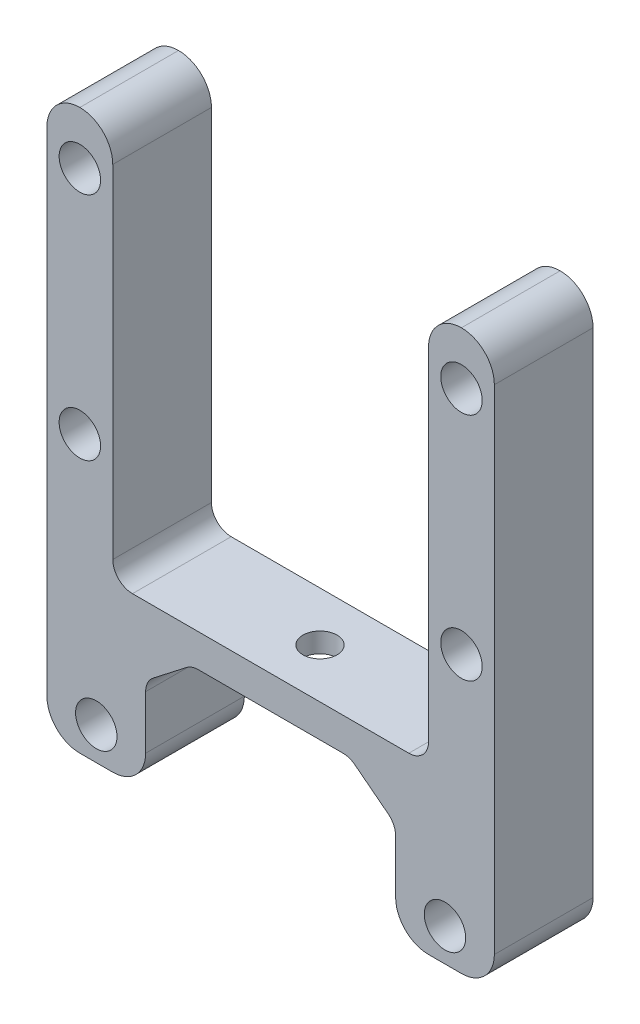
ISO-10303-21;
HEADER;
FILE_DESCRIPTION(('STEP AP214'),'2;1');
FILE_NAME('part.step','',(''),(''),'','','');
FILE_SCHEMA(('AUTOMOTIVE_DESIGN { 1 0 10303 214 1 1 1 1 }'));
ENDSEC;
DATA;
#1=APPLICATION_CONTEXT('core data for automotive mechanical design processes');
#2=APPLICATION_PROTOCOL_DEFINITION('international standard','automotive_design',2000,#1);
#3=PRODUCT_CONTEXT('',#1,'mechanical');
#4=PRODUCT('Part','Part','',(#3));
#5=PRODUCT_RELATED_PRODUCT_CATEGORY('part','',(#4));
#6=PRODUCT_DEFINITION_FORMATION('','',#4);
#7=PRODUCT_DEFINITION_CONTEXT('part definition',#1,'design');
#8=PRODUCT_DEFINITION('design','',#6,#7);
#9=PRODUCT_DEFINITION_SHAPE('','',#8);
#10=(LENGTH_UNIT() NAMED_UNIT(*) SI_UNIT(.MILLI.,.METRE.));
#11=(NAMED_UNIT(*) PLANE_ANGLE_UNIT() SI_UNIT($,.RADIAN.));
#12=(NAMED_UNIT(*) SI_UNIT($,.STERADIAN.) SOLID_ANGLE_UNIT());
#13=UNCERTAINTY_MEASURE_WITH_UNIT(LENGTH_MEASURE(1.E-05),#10,'distance_accuracy_value','');
#14=(GEOMETRIC_REPRESENTATION_CONTEXT(3) GLOBAL_UNCERTAINTY_ASSIGNED_CONTEXT((#13)) GLOBAL_UNIT_ASSIGNED_CONTEXT((#10,
#11,#12)) REPRESENTATION_CONTEXT('',''));
#15=CARTESIAN_POINT('',(0.,0.,0.));
#16=DIRECTION('',(0.,0.,1.));
#17=DIRECTION('',(1.,0.,0.));
#18=AXIS2_PLACEMENT_3D('',#15,#16,#17);
#19=CARTESIAN_POINT('',(0.,0.,15.));
#20=DIRECTION('',(0.,0.,-1.));
#21=DIRECTION('',(-1.,0.,0.));
#22=AXIS2_PLACEMENT_3D('',#19,#20,#21);
#23=PLANE('',#22);
#24=DIRECTION('',(-1.,0.,0.));
#25=VECTOR('',#24,1.);
#26=CARTESIAN_POINT('',(-34.,-20.,15.));
#27=LINE('',#26,#25);
#28=CARTESIAN_POINT('',(-24.,-20.,15.));
#29=VERTEX_POINT('',#28);
#30=CARTESIAN_POINT('',(-29.,-20.,15.));
#31=VERTEX_POINT('',#30);
#32=EDGE_CURVE('E508',#29,#31,#27,.T.);
#33=ORIENTED_EDGE('',*,*,#32,.F.);
#34=CARTESIAN_POINT('',(-24.,-15.,15.));
#35=DIRECTION('',(0.,0.,-1.));
#36=DIRECTION('',(-1.,0.,0.));
#37=AXIS2_PLACEMENT_3D('',#34,#35,#36);
#38=CIRCLE('',#37,5.);
#39=CARTESIAN_POINT('',(-19.,-15.,15.));
#40=VERTEX_POINT('',#39);
#41=EDGE_CURVE('E422',#29,#40,#38,.F.);
#42=ORIENTED_EDGE('',*,*,#41,.T.);
#43=DIRECTION('',(0.,-1.,0.));
#44=VECTOR('',#43,1.);
#45=CARTESIAN_POINT('',(-19.,-20.,15.));
#46=LINE('',#45,#44);
#47=CARTESIAN_POINT('',(-19.,-6.8956900724758,15.));
#48=VERTEX_POINT('',#47);
#49=EDGE_CURVE('E504',#48,#40,#46,.T.);
#50=ORIENTED_EDGE('',*,*,#49,.F.);
#51=CARTESIAN_POINT('',(-16.,-6.8956900724758,15.));
#52=DIRECTION('',(0.,0.,-1.));
#53=DIRECTION('',(-1.,0.,0.));
#54=AXIS2_PLACEMENT_3D('',#51,#52,#53);
#55=CIRCLE('',#54,3.);
#56=CARTESIAN_POINT('',(-17.8377697570417,-4.52448735653122,15.));
#57=VERTEX_POINT('',#56);
#58=EDGE_CURVE('E375',#48,#57,#55,.T.);
#59=ORIENTED_EDGE('',*,*,#58,.T.);
#60=DIRECTION('',(-0.790400905314861,-0.612589919013893,0.));
#61=VECTOR('',#60,1.);
#62=CARTESIAN_POINT('',(-19.,-5.4252587569963,15.));
#63=LINE('',#62,#61);
#64=CARTESIAN_POINT('',(-12.8113126369709,-0.628797284055418,15.));
#65=VERTEX_POINT('',#64);
#66=EDGE_CURVE('E351',#65,#57,#63,.T.);
#67=ORIENTED_EDGE('',*,*,#66,.F.);
#68=CARTESIAN_POINT('',(-10.9735428799292,-3.,15.));
#69=DIRECTION('',(0.,0.,-1.));
#70=DIRECTION('',(-1.,0.,0.));
#71=AXIS2_PLACEMENT_3D('',#68,#69,#70);
#72=CIRCLE('',#71,3.);
#73=CARTESIAN_POINT('',(-10.9735428799292,0.,15.));
#74=VERTEX_POINT('',#73);
#75=EDGE_CURVE('E381',#65,#74,#72,.T.);
#76=ORIENTED_EDGE('',*,*,#75,.T.);
#77=DIRECTION('',(1.,0.,0.));
#78=VECTOR('',#77,1.);
#79=CARTESIAN_POINT('',(12.,0.,15.));
#80=LINE('',#79,#78);
#81=CARTESIAN_POINT('',(10.9735428799292,0.,15.));
#82=VERTEX_POINT('',#81);
#83=EDGE_CURVE('E267',#74,#82,#80,.T.);
#84=ORIENTED_EDGE('',*,*,#83,.T.);
#85=CARTESIAN_POINT('',(10.9735428799292,-3.,15.));
#86=DIRECTION('',(0.,0.,-1.));
#87=DIRECTION('',(-1.,0.,0.));
#88=AXIS2_PLACEMENT_3D('',#85,#86,#87);
#89=CIRCLE('',#88,3.);
#90=CARTESIAN_POINT('',(12.8113126369709,-0.628797284055418,15.));
#91=VERTEX_POINT('',#90);
#92=EDGE_CURVE('E291',#82,#91,#89,.T.);
#93=ORIENTED_EDGE('',*,*,#92,.T.);
#94=DIRECTION('',(0.790400905314861,-0.612589919013893,0.));
#95=VECTOR('',#94,1.);
#96=CARTESIAN_POINT('',(19.,-5.4252587569963,15.));
#97=LINE('',#96,#95);
#98=CARTESIAN_POINT('',(17.8377697570417,-4.52448735653122,15.));
#99=VERTEX_POINT('',#98);
#100=EDGE_CURVE('E445',#91,#99,#97,.T.);
#101=ORIENTED_EDGE('',*,*,#100,.T.);
#102=CARTESIAN_POINT('',(16.,-6.89569007247581,15.));
#103=DIRECTION('',(0.,0.,-1.));
#104=DIRECTION('',(-1.,0.,0.));
#105=AXIS2_PLACEMENT_3D('',#102,#103,#104);
#106=CIRCLE('',#105,3.);
#107=CARTESIAN_POINT('',(19.,-6.89569007247581,15.));
#108=VERTEX_POINT('',#107);
#109=EDGE_CURVE('E225',#99,#108,#106,.T.);
#110=ORIENTED_EDGE('',*,*,#109,.T.);
#111=DIRECTION('',(0.,-1.,0.));
#112=VECTOR('',#111,1.);
#113=CARTESIAN_POINT('',(19.,-20.,15.));
#114=LINE('',#113,#112);
#115=CARTESIAN_POINT('',(19.,-15.,15.));
#116=VERTEX_POINT('',#115);
#117=EDGE_CURVE('E235',#108,#116,#114,.T.);
#118=ORIENTED_EDGE('',*,*,#117,.T.);
#119=CARTESIAN_POINT('',(24.,-15.,15.));
#120=DIRECTION('',(0.,0.,-1.));
#121=DIRECTION('',(-1.,0.,0.));
#122=AXIS2_PLACEMENT_3D('',#119,#120,#121);
#123=CIRCLE('',#122,5.);
#124=CARTESIAN_POINT('',(24.,-20.,15.));
#125=VERTEX_POINT('',#124);
#126=EDGE_CURVE('E331',#116,#125,#123,.F.);
#127=ORIENTED_EDGE('',*,*,#126,.T.);
#128=DIRECTION('',(1.,0.,0.));
#129=VECTOR('',#128,1.);
#130=CARTESIAN_POINT('',(34.,-20.,15.));
#131=LINE('',#130,#129);
#132=CARTESIAN_POINT('',(29.,-20.,15.));
#133=VERTEX_POINT('',#132);
#134=EDGE_CURVE('E439',#125,#133,#131,.T.);
#135=ORIENTED_EDGE('',*,*,#134,.T.);
#136=CARTESIAN_POINT('',(29.,-15.,15.));
#137=DIRECTION('',(0.,0.,-1.));
#138=DIRECTION('',(-1.,0.,0.));
#139=AXIS2_PLACEMENT_3D('',#136,#137,#138);
#140=CIRCLE('',#139,5.);
#141=CARTESIAN_POINT('',(34.,-15.,15.));
#142=VERTEX_POINT('',#141);
#143=EDGE_CURVE('E328',#133,#142,#140,.F.);
#144=ORIENTED_EDGE('',*,*,#143,.T.);
#145=DIRECTION('',(0.,1.,0.));
#146=VECTOR('',#145,1.);
#147=CARTESIAN_POINT('',(34.,65.,15.));
#148=LINE('',#147,#146);
#149=CARTESIAN_POINT('',(34.,60.,15.));
#150=VERTEX_POINT('',#149);
#151=EDGE_CURVE('E435',#142,#150,#148,.T.);
#152=ORIENTED_EDGE('',*,*,#151,.T.);
#153=CARTESIAN_POINT('',(29.,60.,15.));
#154=DIRECTION('',(0.,0.,-1.));
#155=DIRECTION('',(-1.,0.,0.));
#156=AXIS2_PLACEMENT_3D('',#153,#154,#155);
#157=CIRCLE('',#156,5.);
#158=CARTESIAN_POINT('',(29.,65.,15.));
#159=VERTEX_POINT('',#158);
#160=EDGE_CURVE('E322',#150,#159,#157,.F.);
#161=ORIENTED_EDGE('',*,*,#160,.T.);
#162=CARTESIAN_POINT('',(29.,60.,15.));
#163=DIRECTION('',(0.,0.,-1.));
#164=DIRECTION('',(-1.,0.,0.));
#165=AXIS2_PLACEMENT_3D('',#162,#163,#164);
#166=CIRCLE('',#165,5.);
#167=CARTESIAN_POINT('',(24.,60.,15.));
#168=VERTEX_POINT('',#167);
#169=EDGE_CURVE('E325',#159,#168,#166,.F.);
#170=ORIENTED_EDGE('',*,*,#169,.T.);
#171=DIRECTION('',(0.,-1.,0.));
#172=VECTOR('',#171,1.);
#173=CARTESIAN_POINT('',(24.,5.,15.));
#174=LINE('',#173,#172);
#175=CARTESIAN_POINT('',(24.,8.,15.));
#176=VERTEX_POINT('',#175);
#177=EDGE_CURVE('E432',#168,#176,#174,.T.);
#178=ORIENTED_EDGE('',*,*,#177,.T.);
#179=CARTESIAN_POINT('',(21.,8.,15.));
#180=DIRECTION('',(0.,0.,-1.));
#181=DIRECTION('',(-1.,0.,0.));
#182=AXIS2_PLACEMENT_3D('',#179,#180,#181);
#183=CIRCLE('',#182,3.);
#184=CARTESIAN_POINT('',(21.,5.,15.));
#185=VERTEX_POINT('',#184);
#186=EDGE_CURVE('E298',#176,#185,#183,.T.);
#187=ORIENTED_EDGE('',*,*,#186,.T.);
#188=DIRECTION('',(-1.,0.,0.));
#189=VECTOR('',#188,1.);
#190=CARTESIAN_POINT('',(0.,5.,15.));
#191=LINE('',#190,#189);
#192=CARTESIAN_POINT('',(-21.,5.,15.));
#193=VERTEX_POINT('',#192);
#194=EDGE_CURVE('E238',#185,#193,#191,.T.);
#195=ORIENTED_EDGE('',*,*,#194,.T.);
#196=CARTESIAN_POINT('',(-21.,8.,15.));
#197=DIRECTION('',(0.,0.,-1.));
#198=DIRECTION('',(-1.,0.,0.));
#199=AXIS2_PLACEMENT_3D('',#196,#197,#198);
#200=CIRCLE('',#199,3.);
#201=CARTESIAN_POINT('',(-24.,8.,15.));
#202=VERTEX_POINT('',#201);
#203=EDGE_CURVE('E387',#193,#202,#200,.T.);
#204=ORIENTED_EDGE('',*,*,#203,.T.);
#205=DIRECTION('',(0.,-1.,0.));
#206=VECTOR('',#205,1.);
#207=CARTESIAN_POINT('',(-24.,5.,15.));
#208=LINE('',#207,#206);
#209=CARTESIAN_POINT('',(-24.,60.,15.));
#210=VERTEX_POINT('',#209);
#211=EDGE_CURVE('E485',#210,#202,#208,.T.);
#212=ORIENTED_EDGE('',*,*,#211,.F.);
#213=CARTESIAN_POINT('',(-29.,60.,15.));
#214=DIRECTION('',(0.,0.,-1.));
#215=DIRECTION('',(-1.,0.,0.));
#216=AXIS2_PLACEMENT_3D('',#213,#214,#215);
#217=CIRCLE('',#216,5.);
#218=CARTESIAN_POINT('',(-29.,65.,15.));
#219=VERTEX_POINT('',#218);
#220=EDGE_CURVE('E416',#210,#219,#217,.F.);
#221=ORIENTED_EDGE('',*,*,#220,.T.);
#222=CARTESIAN_POINT('',(-29.,60.,15.));
#223=DIRECTION('',(0.,0.,-1.));
#224=DIRECTION('',(-1.,0.,0.));
#225=AXIS2_PLACEMENT_3D('',#222,#223,#224);
#226=CIRCLE('',#225,5.);
#227=CARTESIAN_POINT('',(-34.,60.,15.));
#228=VERTEX_POINT('',#227);
#229=EDGE_CURVE('E56',#219,#228,#226,.F.);
#230=ORIENTED_EDGE('',*,*,#229,.T.);
#231=DIRECTION('',(0.,1.,0.));
#232=VECTOR('',#231,1.);
#233=CARTESIAN_POINT('',(-34.,65.,15.));
#234=LINE('',#233,#232);
#235=CARTESIAN_POINT('',(-34.,-15.,15.));
#236=VERTEX_POINT('',#235);
#237=EDGE_CURVE('E512',#236,#228,#234,.T.);
#238=ORIENTED_EDGE('',*,*,#237,.F.);
#239=CARTESIAN_POINT('',(-29.,-15.,15.));
#240=DIRECTION('',(0.,0.,-1.));
#241=DIRECTION('',(-1.,0.,0.));
#242=AXIS2_PLACEMENT_3D('',#239,#240,#241);
#243=CIRCLE('',#242,5.);
#244=EDGE_CURVE('E419',#236,#31,#243,.F.);
#245=ORIENTED_EDGE('',*,*,#244,.T.);
#246=EDGE_LOOP('',(#33,#42,#50,#59,#67,#76,#84,#93,#101,#110,#118,#127,#135,#144,#152,#161,#170,
#178,#187,#195,#204,#212,#221,#230,#238,#245));
#247=FACE_BOUND('',#246,.T.);
#248=CARTESIAN_POINT('',(29.,57.,15.));
#249=DIRECTION('',(0.,0.,1.));
#250=DIRECTION('',(1.,0.,0.));
#251=AXIS2_PLACEMENT_3D('',#248,#249,#250);
#252=CIRCLE('',#251,3.15);
#253=CARTESIAN_POINT('',(32.15,57.,15.));
#254=VERTEX_POINT('',#253);
#255=EDGE_CURVE('E456',#254,#254,#252,.T.);
#256=ORIENTED_EDGE('',*,*,#255,.F.);
#257=EDGE_LOOP('',(#256));
#258=FACE_BOUND('',#257,.T.);
#259=CARTESIAN_POINT('',(26.5,-15.,15.));
#260=DIRECTION('',(0.,0.,1.));
#261=DIRECTION('',(1.,0.,0.));
#262=AXIS2_PLACEMENT_3D('',#259,#260,#261);
#263=CIRCLE('',#262,3.15);
#264=CARTESIAN_POINT('',(29.65,-15.,15.));
#265=VERTEX_POINT('',#264);
#266=EDGE_CURVE('E465',#265,#265,#263,.T.);
#267=ORIENTED_EDGE('',*,*,#266,.F.);
#268=EDGE_LOOP('',(#267));
#269=FACE_BOUND('',#268,.T.);
#270=CARTESIAN_POINT('',(29.,22.,15.));
#271=DIRECTION('',(0.,0.,1.));
#272=DIRECTION('',(1.,0.,0.));
#273=AXIS2_PLACEMENT_3D('',#270,#271,#272);
#274=CIRCLE('',#273,3.15);
#275=CARTESIAN_POINT('',(32.15,22.,15.));
#276=VERTEX_POINT('',#275);
#277=EDGE_CURVE('E471',#276,#276,#274,.T.);
#278=ORIENTED_EDGE('',*,*,#277,.F.);
#279=EDGE_LOOP('',(#278));
#280=FACE_BOUND('',#279,.T.);
#281=CARTESIAN_POINT('',(-29.,22.,15.));
#282=DIRECTION('',(0.,0.,-1.));
#283=DIRECTION('',(-1.,0.,0.));
#284=AXIS2_PLACEMENT_3D('',#281,#282,#283);
#285=CIRCLE('',#284,3.15);
#286=CARTESIAN_POINT('',(-32.15,22.,15.));
#287=VERTEX_POINT('',#286);
#288=EDGE_CURVE('E529',#287,#287,#285,.T.);
#289=ORIENTED_EDGE('',*,*,#288,.T.);
#290=EDGE_LOOP('',(#289));
#291=FACE_BOUND('',#290,.T.);
#292=CARTESIAN_POINT('',(-26.5,-15.,15.));
#293=DIRECTION('',(0.,0.,-1.));
#294=DIRECTION('',(-1.,0.,0.));
#295=AXIS2_PLACEMENT_3D('',#292,#293,#294);
#296=CIRCLE('',#295,3.15);
#297=CARTESIAN_POINT('',(-29.65,-15.,15.));
#298=VERTEX_POINT('',#297);
#299=EDGE_CURVE('E521',#298,#298,#296,.T.);
#300=ORIENTED_EDGE('',*,*,#299,.T.);
#301=EDGE_LOOP('',(#300));
#302=FACE_BOUND('',#301,.T.);
#303=CARTESIAN_POINT('',(-29.,57.,15.));
#304=DIRECTION('',(0.,0.,-1.));
#305=DIRECTION('',(-1.,0.,0.));
#306=AXIS2_PLACEMENT_3D('',#303,#304,#305);
#307=CIRCLE('',#306,3.15);
#308=CARTESIAN_POINT('',(-32.15,57.,15.));
#309=VERTEX_POINT('',#308);
#310=EDGE_CURVE('E500',#309,#309,#307,.T.);
#311=ORIENTED_EDGE('',*,*,#310,.T.);
#312=EDGE_LOOP('',(#311));
#313=FACE_BOUND('',#312,.T.);
#314=ADVANCED_FACE('F39',(#247,#258,#269,#280,#291,#302,#313),#23,.F.);
#315=CARTESIAN_POINT('',(0.,0.,0.));
#316=DIRECTION('',(0.,0.,-1.));
#317=DIRECTION('',(-1.,0.,0.));
#318=AXIS2_PLACEMENT_3D('',#315,#316,#317);
#319=PLANE('',#318);
#320=CARTESIAN_POINT('',(26.5,-15.,0.));
#321=DIRECTION('',(0.,0.,1.));
#322=DIRECTION('',(1.,0.,0.));
#323=AXIS2_PLACEMENT_3D('',#320,#321,#322);
#324=CIRCLE('',#323,3.15);
#325=CARTESIAN_POINT('',(29.65,-15.,0.));
#326=VERTEX_POINT('',#325);
#327=EDGE_CURVE('E467',#326,#326,#324,.T.);
#328=ORIENTED_EDGE('',*,*,#327,.T.);
#329=EDGE_LOOP('',(#328));
#330=FACE_BOUND('',#329,.T.);
#331=DIRECTION('',(0.,-1.,0.));
#332=VECTOR('',#331,1.);
#333=CARTESIAN_POINT('',(-19.,-20.,0.));
#334=LINE('',#333,#332);
#335=CARTESIAN_POINT('',(-19.,-6.8956900724758,0.));
#336=VERTEX_POINT('',#335);
#337=CARTESIAN_POINT('',(-19.,-15.,0.));
#338=VERTEX_POINT('',#337);
#339=EDGE_CURVE('E486',#336,#338,#334,.T.);
#340=ORIENTED_EDGE('',*,*,#339,.T.);
#341=CARTESIAN_POINT('',(-24.,-15.,0.));
#342=DIRECTION('',(0.,0.,-1.));
#343=DIRECTION('',(-1.,0.,0.));
#344=AXIS2_PLACEMENT_3D('',#341,#342,#343);
#345=CIRCLE('',#344,5.);
#346=CARTESIAN_POINT('',(-24.,-20.,0.));
#347=VERTEX_POINT('',#346);
#348=EDGE_CURVE('E404',#338,#347,#345,.T.);
#349=ORIENTED_EDGE('',*,*,#348,.T.);
#350=DIRECTION('',(-1.,0.,0.));
#351=VECTOR('',#350,1.);
#352=CARTESIAN_POINT('',(-34.,-20.,0.));
#353=LINE('',#352,#351);
#354=CARTESIAN_POINT('',(-29.,-20.,0.));
#355=VERTEX_POINT('',#354);
#356=EDGE_CURVE('E489',#347,#355,#353,.T.);
#357=ORIENTED_EDGE('',*,*,#356,.T.);
#358=CARTESIAN_POINT('',(-29.,-15.,0.));
#359=DIRECTION('',(0.,0.,-1.));
#360=DIRECTION('',(-1.,0.,0.));
#361=AXIS2_PLACEMENT_3D('',#358,#359,#360);
#362=CIRCLE('',#361,5.);
#363=CARTESIAN_POINT('',(-34.,-15.,0.));
#364=VERTEX_POINT('',#363);
#365=EDGE_CURVE('E401',#355,#364,#362,.T.);
#366=ORIENTED_EDGE('',*,*,#365,.T.);
#367=DIRECTION('',(0.,1.,0.));
#368=VECTOR('',#367,1.);
#369=CARTESIAN_POINT('',(-34.,65.,0.));
#370=LINE('',#369,#368);
#371=CARTESIAN_POINT('',(-34.,60.,0.));
#372=VERTEX_POINT('',#371);
#373=EDGE_CURVE('E493',#364,#372,#370,.T.);
#374=ORIENTED_EDGE('',*,*,#373,.T.);
#375=CARTESIAN_POINT('',(-29.,60.,0.));
#376=DIRECTION('',(0.,0.,-1.));
#377=DIRECTION('',(-1.,0.,0.));
#378=AXIS2_PLACEMENT_3D('',#375,#376,#377);
#379=CIRCLE('',#378,5.);
#380=CARTESIAN_POINT('',(-29.,65.,0.));
#381=VERTEX_POINT('',#380);
#382=EDGE_CURVE('E395',#372,#381,#379,.T.);
#383=ORIENTED_EDGE('',*,*,#382,.T.);
#384=CARTESIAN_POINT('',(-29.,60.,0.));
#385=DIRECTION('',(0.,0.,-1.));
#386=DIRECTION('',(-1.,0.,0.));
#387=AXIS2_PLACEMENT_3D('',#384,#385,#386);
#388=CIRCLE('',#387,5.);
#389=CARTESIAN_POINT('',(-24.,60.,0.));
#390=VERTEX_POINT('',#389);
#391=EDGE_CURVE('E398',#381,#390,#388,.T.);
#392=ORIENTED_EDGE('',*,*,#391,.T.);
#393=DIRECTION('',(0.,-1.,0.));
#394=VECTOR('',#393,1.);
#395=CARTESIAN_POINT('',(-24.,5.,0.));
#396=LINE('',#395,#394);
#397=CARTESIAN_POINT('',(-24.,8.,0.));
#398=VERTEX_POINT('',#397);
#399=EDGE_CURVE('E497',#390,#398,#396,.T.);
#400=ORIENTED_EDGE('',*,*,#399,.T.);
#401=CARTESIAN_POINT('',(-21.,8.,0.));
#402=DIRECTION('',(0.,0.,-1.));
#403=DIRECTION('',(-1.,0.,0.));
#404=AXIS2_PLACEMENT_3D('',#401,#402,#403);
#405=CIRCLE('',#404,3.);
#406=CARTESIAN_POINT('',(-21.,5.,0.));
#407=VERTEX_POINT('',#406);
#408=EDGE_CURVE('E384',#398,#407,#405,.F.);
#409=ORIENTED_EDGE('',*,*,#408,.T.);
#410=DIRECTION('',(-1.,0.,0.));
#411=VECTOR('',#410,1.);
#412=CARTESIAN_POINT('',(0.,5.,0.));
#413=LINE('',#412,#411);
#414=CARTESIAN_POINT('',(21.,5.,0.));
#415=VERTEX_POINT('',#414);
#416=EDGE_CURVE('E264',#415,#407,#413,.T.);
#417=ORIENTED_EDGE('',*,*,#416,.F.);
#418=CARTESIAN_POINT('',(21.,8.,0.));
#419=DIRECTION('',(0.,0.,-1.));
#420=DIRECTION('',(-1.,0.,0.));
#421=AXIS2_PLACEMENT_3D('',#418,#419,#420);
#422=CIRCLE('',#421,3.);
#423=CARTESIAN_POINT('',(24.,8.,0.));
#424=VERTEX_POINT('',#423);
#425=EDGE_CURVE('E294',#415,#424,#422,.F.);
#426=ORIENTED_EDGE('',*,*,#425,.T.);
#427=DIRECTION('',(0.,-1.,0.));
#428=VECTOR('',#427,1.);
#429=CARTESIAN_POINT('',(24.,5.,0.));
#430=LINE('',#429,#428);
#431=CARTESIAN_POINT('',(24.,60.,0.));
#432=VERTEX_POINT('',#431);
#433=EDGE_CURVE('E261',#432,#424,#430,.T.);
#434=ORIENTED_EDGE('',*,*,#433,.F.);
#435=CARTESIAN_POINT('',(29.,60.,0.));
#436=DIRECTION('',(0.,0.,-1.));
#437=DIRECTION('',(-1.,0.,0.));
#438=AXIS2_PLACEMENT_3D('',#435,#436,#437);
#439=CIRCLE('',#438,5.);
#440=CARTESIAN_POINT('',(29.,65.,0.));
#441=VERTEX_POINT('',#440);
#442=EDGE_CURVE('E311',#432,#441,#439,.T.);
#443=ORIENTED_EDGE('',*,*,#442,.T.);
#444=CARTESIAN_POINT('',(29.,60.,0.));
#445=DIRECTION('',(0.,0.,-1.));
#446=DIRECTION('',(-1.,0.,0.));
#447=AXIS2_PLACEMENT_3D('',#444,#445,#446);
#448=CIRCLE('',#447,5.);
#449=CARTESIAN_POINT('',(34.,60.,0.));
#450=VERTEX_POINT('',#449);
#451=EDGE_CURVE('E308',#441,#450,#448,.T.);
#452=ORIENTED_EDGE('',*,*,#451,.T.);
#453=DIRECTION('',(0.,1.,0.));
#454=VECTOR('',#453,1.);
#455=CARTESIAN_POINT('',(34.,65.,0.));
#456=LINE('',#455,#454);
#457=CARTESIAN_POINT('',(34.,-15.,0.));
#458=VERTEX_POINT('',#457);
#459=EDGE_CURVE('E252',#458,#450,#456,.T.);
#460=ORIENTED_EDGE('',*,*,#459,.F.);
#461=CARTESIAN_POINT('',(29.,-15.,0.));
#462=DIRECTION('',(0.,0.,-1.));
#463=DIRECTION('',(-1.,0.,0.));
#464=AXIS2_PLACEMENT_3D('',#461,#462,#463);
#465=CIRCLE('',#464,5.);
#466=CARTESIAN_POINT('',(29.,-20.,0.));
#467=VERTEX_POINT('',#466);
#468=EDGE_CURVE('E314',#458,#467,#465,.T.);
#469=ORIENTED_EDGE('',*,*,#468,.T.);
#470=DIRECTION('',(1.,0.,0.));
#471=VECTOR('',#470,1.);
#472=CARTESIAN_POINT('',(34.,-20.,0.));
#473=LINE('',#472,#471);
#474=CARTESIAN_POINT('',(24.,-20.,0.));
#475=VERTEX_POINT('',#474);
#476=EDGE_CURVE('E246',#475,#467,#473,.T.);
#477=ORIENTED_EDGE('',*,*,#476,.F.);
#478=CARTESIAN_POINT('',(24.,-15.,0.));
#479=DIRECTION('',(0.,0.,-1.));
#480=DIRECTION('',(-1.,0.,0.));
#481=AXIS2_PLACEMENT_3D('',#478,#479,#480);
#482=CIRCLE('',#481,5.);
#483=CARTESIAN_POINT('',(19.,-15.,0.));
#484=VERTEX_POINT('',#483);
#485=EDGE_CURVE('E244',#475,#484,#482,.T.);
#486=ORIENTED_EDGE('',*,*,#485,.T.);
#487=DIRECTION('',(0.,-1.,0.));
#488=VECTOR('',#487,1.);
#489=CARTESIAN_POINT('',(19.,-20.,0.));
#490=LINE('',#489,#488);
#491=CARTESIAN_POINT('',(19.,-6.89569007247581,0.));
#492=VERTEX_POINT('',#491);
#493=EDGE_CURVE('E232',#492,#484,#490,.T.);
#494=ORIENTED_EDGE('',*,*,#493,.F.);
#495=CARTESIAN_POINT('',(16.,-6.89569007247581,0.));
#496=DIRECTION('',(0.,0.,-1.));
#497=DIRECTION('',(-1.,0.,0.));
#498=AXIS2_PLACEMENT_3D('',#495,#496,#497);
#499=CIRCLE('',#498,3.);
#500=CARTESIAN_POINT('',(17.8377697570417,-4.52448735653122,0.));
#501=VERTEX_POINT('',#500);
#502=EDGE_CURVE('E214',#492,#501,#499,.F.);
#503=ORIENTED_EDGE('',*,*,#502,.T.);
#504=DIRECTION('',(0.790400905314861,-0.612589919013893,0.));
#505=VECTOR('',#504,1.);
#506=CARTESIAN_POINT('',(19.,-5.4252587569963,0.));
#507=LINE('',#506,#505);
#508=CARTESIAN_POINT('',(12.8113126369709,-0.628797284055418,0.));
#509=VERTEX_POINT('',#508);
#510=EDGE_CURVE('E247',#509,#501,#507,.T.);
#511=ORIENTED_EDGE('',*,*,#510,.F.);
#512=CARTESIAN_POINT('',(10.9735428799292,-3.,0.));
#513=DIRECTION('',(0.,0.,-1.));
#514=DIRECTION('',(-1.,0.,0.));
#515=AXIS2_PLACEMENT_3D('',#512,#513,#514);
#516=CIRCLE('',#515,3.);
#517=CARTESIAN_POINT('',(10.9735428799292,0.,0.));
#518=VERTEX_POINT('',#517);
#519=EDGE_CURVE('E287',#509,#518,#516,.F.);
#520=ORIENTED_EDGE('',*,*,#519,.T.);
#521=DIRECTION('',(1.,0.,0.));
#522=VECTOR('',#521,1.);
#523=CARTESIAN_POINT('',(12.,0.,0.));
#524=LINE('',#523,#522);
#525=CARTESIAN_POINT('',(-10.9735428799292,0.,0.));
#526=VERTEX_POINT('',#525);
#527=EDGE_CURVE('E254',#526,#518,#524,.T.);
#528=ORIENTED_EDGE('',*,*,#527,.F.);
#529=CARTESIAN_POINT('',(-10.9735428799292,-3.,0.));
#530=DIRECTION('',(0.,0.,-1.));
#531=DIRECTION('',(-1.,0.,0.));
#532=AXIS2_PLACEMENT_3D('',#529,#530,#531);
#533=CIRCLE('',#532,3.);
#534=CARTESIAN_POINT('',(-12.8113126369709,-0.628797284055418,0.));
#535=VERTEX_POINT('',#534);
#536=EDGE_CURVE('E378',#526,#535,#533,.F.);
#537=ORIENTED_EDGE('',*,*,#536,.T.);
#538=DIRECTION('',(-0.790400905314861,-0.612589919013893,0.));
#539=VECTOR('',#538,1.);
#540=CARTESIAN_POINT('',(-19.,-5.4252587569963,0.));
#541=LINE('',#540,#539);
#542=CARTESIAN_POINT('',(-17.8377697570417,-4.52448735653122,0.));
#543=VERTEX_POINT('',#542);
#544=EDGE_CURVE('E481',#535,#543,#541,.T.);
#545=ORIENTED_EDGE('',*,*,#544,.T.);
#546=CARTESIAN_POINT('',(-16.,-6.8956900724758,0.));
#547=DIRECTION('',(0.,0.,-1.));
#548=DIRECTION('',(-1.,0.,0.));
#549=AXIS2_PLACEMENT_3D('',#546,#547,#548);
#550=CIRCLE('',#549,3.);
#551=EDGE_CURVE('E372',#543,#336,#550,.F.);
#552=ORIENTED_EDGE('',*,*,#551,.T.);
#553=EDGE_LOOP('',(#340,#349,#357,#366,#374,#383,#392,#400,#409,#417,#426,#434,#443,#452,#460,
#469,#477,#486,#494,#503,#511,#520,#528,#537,#545,#552));
#554=FACE_BOUND('',#553,.T.);
#555=CARTESIAN_POINT('',(29.,57.,0.));
#556=DIRECTION('',(0.,0.,1.));
#557=DIRECTION('',(1.,0.,0.));
#558=AXIS2_PLACEMENT_3D('',#555,#556,#557);
#559=CIRCLE('',#558,3.15);
#560=CARTESIAN_POINT('',(32.15,57.,0.));
#561=VERTEX_POINT('',#560);
#562=EDGE_CURVE('E453',#561,#561,#559,.T.);
#563=ORIENTED_EDGE('',*,*,#562,.T.);
#564=EDGE_LOOP('',(#563));
#565=FACE_BOUND('',#564,.T.);
#566=CARTESIAN_POINT('',(29.,22.,0.));
#567=DIRECTION('',(0.,0.,1.));
#568=DIRECTION('',(1.,0.,0.));
#569=AXIS2_PLACEMENT_3D('',#566,#567,#568);
#570=CIRCLE('',#569,3.15);
#571=CARTESIAN_POINT('',(32.15,22.,0.));
#572=VERTEX_POINT('',#571);
#573=EDGE_CURVE('E350',#572,#572,#570,.T.);
#574=ORIENTED_EDGE('',*,*,#573,.T.);
#575=EDGE_LOOP('',(#574));
#576=FACE_BOUND('',#575,.T.);
#577=CARTESIAN_POINT('',(-29.,22.,0.));
#578=DIRECTION('',(0.,0.,-1.));
#579=DIRECTION('',(-1.,0.,0.));
#580=AXIS2_PLACEMENT_3D('',#577,#578,#579);
#581=CIRCLE('',#580,3.15);
#582=CARTESIAN_POINT('',(-32.15,22.,0.));
#583=VERTEX_POINT('',#582);
#584=EDGE_CURVE('E533',#583,#583,#581,.T.);
#585=ORIENTED_EDGE('',*,*,#584,.F.);
#586=EDGE_LOOP('',(#585));
#587=FACE_BOUND('',#586,.T.);
#588=CARTESIAN_POINT('',(-26.5,-15.,0.));
#589=DIRECTION('',(0.,0.,-1.));
#590=DIRECTION('',(-1.,0.,0.));
#591=AXIS2_PLACEMENT_3D('',#588,#589,#590);
#592=CIRCLE('',#591,3.15);
#593=CARTESIAN_POINT('',(-29.65,-15.,0.));
#594=VERTEX_POINT('',#593);
#595=EDGE_CURVE('E525',#594,#594,#592,.T.);
#596=ORIENTED_EDGE('',*,*,#595,.F.);
#597=EDGE_LOOP('',(#596));
#598=FACE_BOUND('',#597,.T.);
#599=CARTESIAN_POINT('',(-29.,57.,0.));
#600=DIRECTION('',(0.,0.,-1.));
#601=DIRECTION('',(-1.,0.,0.));
#602=AXIS2_PLACEMENT_3D('',#599,#600,#601);
#603=CIRCLE('',#602,3.15);
#604=CARTESIAN_POINT('',(-32.15,57.,0.));
#605=VERTEX_POINT('',#604);
#606=EDGE_CURVE('E517',#605,#605,#603,.T.);
#607=ORIENTED_EDGE('',*,*,#606,.F.);
#608=EDGE_LOOP('',(#607));
#609=FACE_BOUND('',#608,.T.);
#610=ADVANCED_FACE('F241',(#330,#554,#565,#576,#587,#598,#609),#319,.T.);
#611=CARTESIAN_POINT('',(12.,0.,15.));
#612=DIRECTION('',(0.,1.,0.));
#613=DIRECTION('',(0.,0.,1.));
#614=AXIS2_PLACEMENT_3D('',#611,#612,#613);
#615=PLANE('',#614);
#616=CARTESIAN_POINT('',(0.,0.,7.5));
#617=DIRECTION('',(0.,-1.,0.));
#618=DIRECTION('',(0.,0.,-1.));
#619=AXIS2_PLACEMENT_3D('',#616,#617,#618);
#620=CIRCLE('',#619,5.75);
#621=CARTESIAN_POINT('',(0.,0.,1.75));
#622=VERTEX_POINT('',#621);
#623=EDGE_CURVE('E540',#622,#622,#620,.T.);
#624=ORIENTED_EDGE('',*,*,#623,.F.);
#625=EDGE_LOOP('',(#624));
#626=FACE_BOUND('',#625,.T.);
#627=ORIENTED_EDGE('',*,*,#83,.F.);
#628=DIRECTION('',(0.,0.,-1.));
#629=VECTOR('',#628,1.);
#630=CARTESIAN_POINT('',(-10.9735428799292,0.,15.));
#631=LINE('',#630,#629);
#632=EDGE_CURVE('E361',#74,#526,#631,.T.);
#633=ORIENTED_EDGE('',*,*,#632,.T.);
#634=ORIENTED_EDGE('',*,*,#527,.T.);
#635=DIRECTION('',(0.,0.,-1.));
#636=VECTOR('',#635,1.);
#637=CARTESIAN_POINT('',(10.9735428799292,0.,15.));
#638=LINE('',#637,#636);
#639=EDGE_CURVE('E274',#518,#82,#638,.F.);
#640=ORIENTED_EDGE('',*,*,#639,.T.);
#641=EDGE_LOOP('',(#627,#633,#634,#640));
#642=FACE_BOUND('',#641,.T.);
#643=ADVANCED_FACE('F573',(#626,#642),#615,.F.);
#644=CARTESIAN_POINT('',(19.,-5.4252587569963,15.));
#645=DIRECTION('',(0.612589919013893,0.790400905314861,0.));
#646=DIRECTION('',(-0.790400905314861,0.612589919013893,0.));
#647=AXIS2_PLACEMENT_3D('',#644,#645,#646);
#648=PLANE('',#647);
#649=ORIENTED_EDGE('',*,*,#510,.T.);
#650=DIRECTION('',(0.,0.,-1.));
#651=VECTOR('',#650,1.);
#652=CARTESIAN_POINT('',(17.8377697570417,-4.52448735653122,15.));
#653=LINE('',#652,#651);
#654=EDGE_CURVE('E219',#501,#99,#653,.F.);
#655=ORIENTED_EDGE('',*,*,#654,.T.);
#656=ORIENTED_EDGE('',*,*,#100,.F.);
#657=DIRECTION('',(0.,0.,-1.));
#658=VECTOR('',#657,1.);
#659=CARTESIAN_POINT('',(12.8113126369709,-0.628797284055418,0.));
#660=LINE('',#659,#658);
#661=EDGE_CURVE('E237',#91,#509,#660,.T.);
#662=ORIENTED_EDGE('',*,*,#661,.T.);
#663=EDGE_LOOP('',(#649,#655,#656,#662));
#664=FACE_BOUND('',#663,.T.);
#665=ADVANCED_FACE('F575',(#664),#648,.F.);
#666=CARTESIAN_POINT('',(19.,-20.,15.));
#667=DIRECTION('',(1.,0.,0.));
#668=DIRECTION('',(0.,0.,-1.));
#669=AXIS2_PLACEMENT_3D('',#666,#667,#668);
#670=PLANE('',#669);
#671=ORIENTED_EDGE('',*,*,#493,.T.);
#672=DIRECTION('',(0.,0.,-1.));
#673=VECTOR('',#672,1.);
#674=CARTESIAN_POINT('',(19.,-15.,15.));
#675=LINE('',#674,#673);
#676=EDGE_CURVE('E319',#484,#116,#675,.F.);
#677=ORIENTED_EDGE('',*,*,#676,.T.);
#678=ORIENTED_EDGE('',*,*,#117,.F.);
#679=DIRECTION('',(0.,0.,-1.));
#680=VECTOR('',#679,1.);
#681=CARTESIAN_POINT('',(19.,-6.89569007247581,0.));
#682=LINE('',#681,#680);
#683=EDGE_CURVE('E218',#108,#492,#682,.T.);
#684=ORIENTED_EDGE('',*,*,#683,.T.);
#685=EDGE_LOOP('',(#671,#677,#678,#684));
#686=FACE_BOUND('',#685,.T.);
#687=ADVANCED_FACE('F231',(#686),#670,.F.);
#688=CARTESIAN_POINT('',(34.,-20.,15.));
#689=DIRECTION('',(0.,1.,0.));
#690=DIRECTION('',(0.,0.,1.));
#691=AXIS2_PLACEMENT_3D('',#688,#689,#690);
#692=PLANE('',#691);
#693=ORIENTED_EDGE('',*,*,#134,.F.);
#694=DIRECTION('',(0.,0.,-1.));
#695=VECTOR('',#694,1.);
#696=CARTESIAN_POINT('',(24.,-20.,15.));
#697=LINE('',#696,#695);
#698=EDGE_CURVE('E304',#125,#475,#697,.T.);
#699=ORIENTED_EDGE('',*,*,#698,.T.);
#700=ORIENTED_EDGE('',*,*,#476,.T.);
#701=DIRECTION('',(0.,0.,-1.));
#702=VECTOR('',#701,1.);
#703=CARTESIAN_POINT('',(29.,-20.,15.));
#704=LINE('',#703,#702);
#705=EDGE_CURVE('E301',#467,#133,#704,.F.);
#706=ORIENTED_EDGE('',*,*,#705,.T.);
#707=EDGE_LOOP('',(#693,#699,#700,#706));
#708=FACE_BOUND('',#707,.T.);
#709=ADVANCED_FACE('F664',(#708),#692,.F.);
#710=CARTESIAN_POINT('',(34.,65.,15.));
#711=DIRECTION('',(-1.,0.,0.));
#712=DIRECTION('',(0.,-1.,0.));
#713=AXIS2_PLACEMENT_3D('',#710,#711,#712);
#714=PLANE('',#713);
#715=ORIENTED_EDGE('',*,*,#151,.F.);
#716=DIRECTION('',(0.,0.,-1.));
#717=VECTOR('',#716,1.);
#718=CARTESIAN_POINT('',(34.,-15.,15.));
#719=LINE('',#718,#717);
#720=EDGE_CURVE('E337',#142,#458,#719,.T.);
#721=ORIENTED_EDGE('',*,*,#720,.T.);
#722=ORIENTED_EDGE('',*,*,#459,.T.);
#723=DIRECTION('',(0.,0.,-1.));
#724=VECTOR('',#723,1.);
#725=CARTESIAN_POINT('',(34.,60.,15.));
#726=LINE('',#725,#724);
#727=EDGE_CURVE('E334',#450,#150,#726,.F.);
#728=ORIENTED_EDGE('',*,*,#727,.T.);
#729=EDGE_LOOP('',(#715,#721,#722,#728));
#730=FACE_BOUND('',#729,.T.);
#731=ADVANCED_FACE('F656',(#730),#714,.F.);
#732=CARTESIAN_POINT('',(24.,5.,15.));
#733=DIRECTION('',(1.,0.,0.));
#734=DIRECTION('',(0.,1.,0.));
#735=AXIS2_PLACEMENT_3D('',#732,#733,#734);
#736=PLANE('',#735);
#737=ORIENTED_EDGE('',*,*,#177,.F.);
#738=DIRECTION('',(0.,0.,-1.));
#739=VECTOR('',#738,1.);
#740=CARTESIAN_POINT('',(24.,60.,15.));
#741=LINE('',#740,#739);
#742=EDGE_CURVE('E341',#168,#432,#741,.T.);
#743=ORIENTED_EDGE('',*,*,#742,.T.);
#744=ORIENTED_EDGE('',*,*,#433,.T.);
#745=DIRECTION('',(0.,0.,-1.));
#746=VECTOR('',#745,1.);
#747=CARTESIAN_POINT('',(24.,8.,15.));
#748=LINE('',#747,#746);
#749=EDGE_CURVE('E226',#424,#176,#748,.F.);
#750=ORIENTED_EDGE('',*,*,#749,.T.);
#751=EDGE_LOOP('',(#737,#743,#744,#750));
#752=FACE_BOUND('',#751,.T.);
#753=ADVANCED_FACE('F643',(#752),#736,.F.);
#754=CARTESIAN_POINT('',(0.,5.,15.));
#755=DIRECTION('',(0.,-1.,0.));
#756=DIRECTION('',(0.,0.,-1.));
#757=AXIS2_PLACEMENT_3D('',#754,#755,#756);
#758=PLANE('',#757);
#759=CARTESIAN_POINT('',(0.,5.,7.5));
#760=DIRECTION('',(0.,-1.,0.));
#761=DIRECTION('',(0.,0.,-1.));
#762=AXIS2_PLACEMENT_3D('',#759,#760,#761);
#763=CIRCLE('',#762,2.6);
#764=CARTESIAN_POINT('',(0.,5.,4.9));
#765=VERTEX_POINT('',#764);
#766=EDGE_CURVE('E545',#765,#765,#763,.F.);
#767=ORIENTED_EDGE('',*,*,#766,.F.);
#768=EDGE_LOOP('',(#767));
#769=FACE_BOUND('',#768,.T.);
#770=ORIENTED_EDGE('',*,*,#416,.T.);
#771=DIRECTION('',(0.,0.,-1.));
#772=VECTOR('',#771,1.);
#773=CARTESIAN_POINT('',(-21.,5.,15.));
#774=LINE('',#773,#772);
#775=EDGE_CURVE('E369',#407,#193,#774,.F.);
#776=ORIENTED_EDGE('',*,*,#775,.T.);
#777=ORIENTED_EDGE('',*,*,#194,.F.);
#778=DIRECTION('',(0.,0.,-1.));
#779=VECTOR('',#778,1.);
#780=CARTESIAN_POINT('',(21.,5.,0.));
#781=LINE('',#780,#779);
#782=EDGE_CURVE('E278',#185,#415,#781,.T.);
#783=ORIENTED_EDGE('',*,*,#782,.T.);
#784=EDGE_LOOP('',(#770,#776,#777,#783));
#785=FACE_BOUND('',#784,.T.);
#786=ADVANCED_FACE('F633',(#769,#785),#758,.F.);
#787=CARTESIAN_POINT('',(29.,57.,15.));
#788=DIRECTION('',(0.,0.,-1.));
#789=DIRECTION('',(-1.,0.,0.));
#790=AXIS2_PLACEMENT_3D('',#787,#788,#789);
#791=CYLINDRICAL_SURFACE('',#790,3.15);
#792=ORIENTED_EDGE('',*,*,#255,.T.);
#793=EDGE_LOOP('',(#792));
#794=FACE_BOUND('',#793,.T.);
#795=ORIENTED_EDGE('',*,*,#562,.F.);
#796=EDGE_LOOP('',(#795));
#797=FACE_BOUND('',#796,.T.);
#798=ADVANCED_FACE('F691',(#794,#797),#791,.F.);
#799=CARTESIAN_POINT('',(26.5,-15.,15.));
#800=DIRECTION('',(0.,0.,-1.));
#801=DIRECTION('',(-1.,0.,0.));
#802=AXIS2_PLACEMENT_3D('',#799,#800,#801);
#803=CYLINDRICAL_SURFACE('',#802,3.15);
#804=ORIENTED_EDGE('',*,*,#266,.T.);
#805=EDGE_LOOP('',(#804));
#806=FACE_BOUND('',#805,.T.);
#807=ORIENTED_EDGE('',*,*,#327,.F.);
#808=EDGE_LOOP('',(#807));
#809=FACE_BOUND('',#808,.T.);
#810=ADVANCED_FACE('F742',(#806,#809),#803,.F.);
#811=CARTESIAN_POINT('',(29.,22.,15.));
#812=DIRECTION('',(0.,0.,-1.));
#813=DIRECTION('',(-1.,0.,0.));
#814=AXIS2_PLACEMENT_3D('',#811,#812,#813);
#815=CYLINDRICAL_SURFACE('',#814,3.15);
#816=ORIENTED_EDGE('',*,*,#277,.T.);
#817=EDGE_LOOP('',(#816));
#818=FACE_BOUND('',#817,.T.);
#819=ORIENTED_EDGE('',*,*,#573,.F.);
#820=EDGE_LOOP('',(#819));
#821=FACE_BOUND('',#820,.T.);
#822=ADVANCED_FACE('F681',(#818,#821),#815,.F.);
#823=CARTESIAN_POINT('',(16.,-6.89569007247581,15.));
#824=DIRECTION('',(0.,0.,1.));
#825=DIRECTION('',(1.,0.,0.));
#826=AXIS2_PLACEMENT_3D('',#823,#824,#825);
#827=CYLINDRICAL_SURFACE('',#826,3.);
#828=ORIENTED_EDGE('',*,*,#109,.F.);
#829=ORIENTED_EDGE('',*,*,#654,.F.);
#830=ORIENTED_EDGE('',*,*,#502,.F.);
#831=ORIENTED_EDGE('',*,*,#683,.F.);
#832=EDGE_LOOP('',(#828,#829,#830,#831));
#833=FACE_BOUND('',#832,.T.);
#834=ADVANCED_FACE('F217',(#833),#827,.F.);
#835=CARTESIAN_POINT('',(10.9735428799292,-3.,15.));
#836=DIRECTION('',(0.,0.,1.));
#837=DIRECTION('',(1.,0.,0.));
#838=AXIS2_PLACEMENT_3D('',#835,#836,#837);
#839=CYLINDRICAL_SURFACE('',#838,3.);
#840=ORIENTED_EDGE('',*,*,#92,.F.);
#841=ORIENTED_EDGE('',*,*,#639,.F.);
#842=ORIENTED_EDGE('',*,*,#519,.F.);
#843=ORIENTED_EDGE('',*,*,#661,.F.);
#844=EDGE_LOOP('',(#840,#841,#842,#843));
#845=FACE_BOUND('',#844,.T.);
#846=ADVANCED_FACE('F673',(#845),#839,.F.);
#847=CARTESIAN_POINT('',(21.,8.,15.));
#848=DIRECTION('',(0.,0.,1.));
#849=DIRECTION('',(1.,0.,0.));
#850=AXIS2_PLACEMENT_3D('',#847,#848,#849);
#851=CYLINDRICAL_SURFACE('',#850,3.);
#852=ORIENTED_EDGE('',*,*,#186,.F.);
#853=ORIENTED_EDGE('',*,*,#749,.F.);
#854=ORIENTED_EDGE('',*,*,#425,.F.);
#855=ORIENTED_EDGE('',*,*,#782,.F.);
#856=EDGE_LOOP('',(#852,#853,#854,#855));
#857=FACE_BOUND('',#856,.T.);
#858=ADVANCED_FACE('F637',(#857),#851,.F.);
#859=CARTESIAN_POINT('',(24.,-15.,15.));
#860=DIRECTION('',(0.,0.,-1.));
#861=DIRECTION('',(-1.,0.,0.));
#862=AXIS2_PLACEMENT_3D('',#859,#860,#861);
#863=CYLINDRICAL_SURFACE('',#862,5.);
#864=ORIENTED_EDGE('',*,*,#126,.F.);
#865=ORIENTED_EDGE('',*,*,#676,.F.);
#866=ORIENTED_EDGE('',*,*,#485,.F.);
#867=ORIENTED_EDGE('',*,*,#698,.F.);
#868=EDGE_LOOP('',(#864,#865,#866,#867));
#869=FACE_BOUND('',#868,.T.);
#870=ADVANCED_FACE('F668',(#869),#863,.T.);
#871=CARTESIAN_POINT('',(29.,-15.,15.));
#872=DIRECTION('',(0.,0.,-1.));
#873=DIRECTION('',(-1.,0.,0.));
#874=AXIS2_PLACEMENT_3D('',#871,#872,#873);
#875=CYLINDRICAL_SURFACE('',#874,5.);
#876=ORIENTED_EDGE('',*,*,#143,.F.);
#877=ORIENTED_EDGE('',*,*,#705,.F.);
#878=ORIENTED_EDGE('',*,*,#468,.F.);
#879=ORIENTED_EDGE('',*,*,#720,.F.);
#880=EDGE_LOOP('',(#876,#877,#878,#879));
#881=FACE_BOUND('',#880,.T.);
#882=ADVANCED_FACE('F660',(#881),#875,.T.);
#883=CARTESIAN_POINT('',(29.,60.,15.));
#884=DIRECTION('',(0.,0.,-1.));
#885=DIRECTION('',(-1.,0.,0.));
#886=AXIS2_PLACEMENT_3D('',#883,#884,#885);
#887=CYLINDRICAL_SURFACE('',#886,5.);
#888=DIRECTION('',(0.,0.,-1.));
#889=VECTOR('',#888,1.);
#890=CARTESIAN_POINT('',(29.,65.,15.));
#891=LINE('',#890,#889);
#892=EDGE_CURVE('E346',#159,#441,#891,.T.);
#893=ORIENTED_EDGE('',*,*,#892,.F.);
#894=ORIENTED_EDGE('',*,*,#160,.F.);
#895=ORIENTED_EDGE('',*,*,#727,.F.);
#896=ORIENTED_EDGE('',*,*,#451,.F.);
#897=EDGE_LOOP('',(#893,#894,#895,#896));
#898=FACE_BOUND('',#897,.T.);
#899=ADVANCED_FACE('F651',(#898),#887,.T.);
#900=CARTESIAN_POINT('',(29.,60.,15.));
#901=DIRECTION('',(0.,0.,-1.));
#902=DIRECTION('',(-1.,0.,0.));
#903=AXIS2_PLACEMENT_3D('',#900,#901,#902);
#904=CYLINDRICAL_SURFACE('',#903,5.);
#905=ORIENTED_EDGE('',*,*,#169,.F.);
#906=ORIENTED_EDGE('',*,*,#892,.T.);
#907=ORIENTED_EDGE('',*,*,#442,.F.);
#908=ORIENTED_EDGE('',*,*,#742,.F.);
#909=EDGE_LOOP('',(#905,#906,#907,#908));
#910=FACE_BOUND('',#909,.T.);
#911=ADVANCED_FACE('F647',(#910),#904,.T.);
#912=CARTESIAN_POINT('',(-24.,5.,15.));
#913=DIRECTION('',(1.,0.,0.));
#914=DIRECTION('',(0.,1.,0.));
#915=AXIS2_PLACEMENT_3D('',#912,#913,#914);
#916=PLANE('',#915);
#917=ORIENTED_EDGE('',*,*,#399,.F.);
#918=DIRECTION('',(0.,0.,-1.));
#919=VECTOR('',#918,1.);
#920=CARTESIAN_POINT('',(-24.,60.,15.));
#921=LINE('',#920,#919);
#922=EDGE_CURVE('E11',#390,#210,#921,.F.);
#923=ORIENTED_EDGE('',*,*,#922,.T.);
#924=ORIENTED_EDGE('',*,*,#211,.T.);
#925=DIRECTION('',(0.,0.,-1.));
#926=VECTOR('',#925,1.);
#927=CARTESIAN_POINT('',(-24.,8.,15.));
#928=LINE('',#927,#926);
#929=EDGE_CURVE('E365',#202,#398,#928,.T.);
#930=ORIENTED_EDGE('',*,*,#929,.T.);
#931=EDGE_LOOP('',(#917,#923,#924,#930));
#932=FACE_BOUND('',#931,.T.);
#933=ADVANCED_FACE('F622',(#932),#916,.T.);
#934=CARTESIAN_POINT('',(-34.,65.,15.));
#935=DIRECTION('',(-1.,0.,0.));
#936=DIRECTION('',(0.,-1.,0.));
#937=AXIS2_PLACEMENT_3D('',#934,#935,#936);
#938=PLANE('',#937);
#939=ORIENTED_EDGE('',*,*,#373,.F.);
#940=DIRECTION('',(0.,0.,-1.));
#941=VECTOR('',#940,1.);
#942=CARTESIAN_POINT('',(-34.,-15.,15.));
#943=LINE('',#942,#941);
#944=EDGE_CURVE('E49',#364,#236,#943,.F.);
#945=ORIENTED_EDGE('',*,*,#944,.T.);
#946=ORIENTED_EDGE('',*,*,#237,.T.);
#947=DIRECTION('',(0.,0.,-1.));
#948=VECTOR('',#947,1.);
#949=CARTESIAN_POINT('',(-34.,60.,15.));
#950=LINE('',#949,#948);
#951=EDGE_CURVE('E425',#228,#372,#950,.T.);
#952=ORIENTED_EDGE('',*,*,#951,.T.);
#953=EDGE_LOOP('',(#939,#945,#946,#952));
#954=FACE_BOUND('',#953,.T.);
#955=ADVANCED_FACE('F611',(#954),#938,.T.);
#956=CARTESIAN_POINT('',(-34.,-20.,15.));
#957=DIRECTION('',(0.,-1.,0.));
#958=DIRECTION('',(0.,0.,-1.));
#959=AXIS2_PLACEMENT_3D('',#956,#957,#958);
#960=PLANE('',#959);
#961=ORIENTED_EDGE('',*,*,#356,.F.);
#962=DIRECTION('',(0.,0.,-1.));
#963=VECTOR('',#962,1.);
#964=CARTESIAN_POINT('',(-24.,-20.,15.));
#965=LINE('',#964,#963);
#966=EDGE_CURVE('E411',#347,#29,#965,.F.);
#967=ORIENTED_EDGE('',*,*,#966,.T.);
#968=ORIENTED_EDGE('',*,*,#32,.T.);
#969=DIRECTION('',(0.,0.,-1.));
#970=VECTOR('',#969,1.);
#971=CARTESIAN_POINT('',(-29.,-20.,15.));
#972=LINE('',#971,#970);
#973=EDGE_CURVE('E407',#31,#355,#972,.T.);
#974=ORIENTED_EDGE('',*,*,#973,.T.);
#975=EDGE_LOOP('',(#961,#967,#968,#974));
#976=FACE_BOUND('',#975,.T.);
#977=ADVANCED_FACE('F604',(#976),#960,.T.);
#978=CARTESIAN_POINT('',(-19.,-20.,15.));
#979=DIRECTION('',(1.,0.,0.));
#980=DIRECTION('',(0.,0.,-1.));
#981=AXIS2_PLACEMENT_3D('',#978,#979,#980);
#982=PLANE('',#981);
#983=ORIENTED_EDGE('',*,*,#49,.T.);
#984=DIRECTION('',(0.,0.,-1.));
#985=VECTOR('',#984,1.);
#986=CARTESIAN_POINT('',(-19.,-15.,15.));
#987=LINE('',#986,#985);
#988=EDGE_CURVE('E391',#40,#338,#987,.T.);
#989=ORIENTED_EDGE('',*,*,#988,.T.);
#990=ORIENTED_EDGE('',*,*,#339,.F.);
#991=DIRECTION('',(0.,0.,-1.));
#992=VECTOR('',#991,1.);
#993=CARTESIAN_POINT('',(-19.,-6.8956900724758,15.));
#994=LINE('',#993,#992);
#995=EDGE_CURVE('E358',#336,#48,#994,.F.);
#996=ORIENTED_EDGE('',*,*,#995,.T.);
#997=EDGE_LOOP('',(#983,#989,#990,#996));
#998=FACE_BOUND('',#997,.T.);
#999=ADVANCED_FACE('F595',(#998),#982,.T.);
#1000=CARTESIAN_POINT('',(-19.,-5.4252587569963,15.));
#1001=DIRECTION('',(0.612589919013893,-0.790400905314861,0.));
#1002=DIRECTION('',(0.790400905314861,0.612589919013893,0.));
#1003=AXIS2_PLACEMENT_3D('',#1000,#1001,#1002);
#1004=PLANE('',#1003);
#1005=ORIENTED_EDGE('',*,*,#66,.T.);
#1006=DIRECTION('',(0.,0.,-1.));
#1007=VECTOR('',#1006,1.);
#1008=CARTESIAN_POINT('',(-17.8377697570417,-4.52448735653122,0.));
#1009=LINE('',#1008,#1007);
#1010=EDGE_CURVE('E354',#57,#543,#1009,.T.);
#1011=ORIENTED_EDGE('',*,*,#1010,.T.);
#1012=ORIENTED_EDGE('',*,*,#544,.F.);
#1013=DIRECTION('',(0.,0.,-1.));
#1014=VECTOR('',#1013,1.);
#1015=CARTESIAN_POINT('',(-12.8113126369709,-0.628797284055417,15.));
#1016=LINE('',#1015,#1014);
#1017=EDGE_CURVE('E345',#535,#65,#1016,.F.);
#1018=ORIENTED_EDGE('',*,*,#1017,.T.);
#1019=EDGE_LOOP('',(#1005,#1011,#1012,#1018));
#1020=FACE_BOUND('',#1019,.T.);
#1021=ADVANCED_FACE('F586',(#1020),#1004,.T.);
#1022=CARTESIAN_POINT('',(-29.,57.,15.));
#1023=DIRECTION('',(0.,0.,-1.));
#1024=DIRECTION('',(-1.,0.,0.));
#1025=AXIS2_PLACEMENT_3D('',#1022,#1023,#1024);
#1026=CYLINDRICAL_SURFACE('',#1025,3.15);
#1027=ORIENTED_EDGE('',*,*,#310,.F.);
#1028=EDGE_LOOP('',(#1027));
#1029=FACE_BOUND('',#1028,.T.);
#1030=ORIENTED_EDGE('',*,*,#606,.T.);
#1031=EDGE_LOOP('',(#1030));
#1032=FACE_BOUND('',#1031,.T.);
#1033=ADVANCED_FACE('F822',(#1029,#1032),#1026,.F.);
#1034=CARTESIAN_POINT('',(-26.5,-15.,15.));
#1035=DIRECTION('',(0.,0.,-1.));
#1036=DIRECTION('',(-1.,0.,0.));
#1037=AXIS2_PLACEMENT_3D('',#1034,#1035,#1036);
#1038=CYLINDRICAL_SURFACE('',#1037,3.15);
#1039=ORIENTED_EDGE('',*,*,#299,.F.);
#1040=EDGE_LOOP('',(#1039));
#1041=FACE_BOUND('',#1040,.T.);
#1042=ORIENTED_EDGE('',*,*,#595,.T.);
#1043=EDGE_LOOP('',(#1042));
#1044=FACE_BOUND('',#1043,.T.);
#1045=ADVANCED_FACE('F829',(#1041,#1044),#1038,.F.);
#1046=CARTESIAN_POINT('',(-29.,22.,15.));
#1047=DIRECTION('',(0.,0.,-1.));
#1048=DIRECTION('',(-1.,0.,0.));
#1049=AXIS2_PLACEMENT_3D('',#1046,#1047,#1048);
#1050=CYLINDRICAL_SURFACE('',#1049,3.15);
#1051=ORIENTED_EDGE('',*,*,#288,.F.);
#1052=EDGE_LOOP('',(#1051));
#1053=FACE_BOUND('',#1052,.T.);
#1054=ORIENTED_EDGE('',*,*,#584,.T.);
#1055=EDGE_LOOP('',(#1054));
#1056=FACE_BOUND('',#1055,.T.);
#1057=ADVANCED_FACE('F837',(#1053,#1056),#1050,.F.);
#1058=CARTESIAN_POINT('',(-16.,-6.8956900724758,15.));
#1059=DIRECTION('',(0.,0.,1.));
#1060=DIRECTION('',(1.,0.,0.));
#1061=AXIS2_PLACEMENT_3D('',#1058,#1059,#1060);
#1062=CYLINDRICAL_SURFACE('',#1061,3.);
#1063=ORIENTED_EDGE('',*,*,#58,.F.);
#1064=ORIENTED_EDGE('',*,*,#995,.F.);
#1065=ORIENTED_EDGE('',*,*,#551,.F.);
#1066=ORIENTED_EDGE('',*,*,#1010,.F.);
#1067=EDGE_LOOP('',(#1063,#1064,#1065,#1066));
#1068=FACE_BOUND('',#1067,.T.);
#1069=ADVANCED_FACE('F591',(#1068),#1062,.F.);
#1070=CARTESIAN_POINT('',(-10.9735428799292,-3.,15.));
#1071=DIRECTION('',(0.,0.,-1.));
#1072=DIRECTION('',(-1.,0.,0.));
#1073=AXIS2_PLACEMENT_3D('',#1070,#1071,#1072);
#1074=CYLINDRICAL_SURFACE('',#1073,3.);
#1075=ORIENTED_EDGE('',*,*,#75,.F.);
#1076=ORIENTED_EDGE('',*,*,#1017,.F.);
#1077=ORIENTED_EDGE('',*,*,#536,.F.);
#1078=ORIENTED_EDGE('',*,*,#632,.F.);
#1079=EDGE_LOOP('',(#1075,#1076,#1077,#1078));
#1080=FACE_BOUND('',#1079,.T.);
#1081=ADVANCED_FACE('F582',(#1080),#1074,.F.);
#1082=CARTESIAN_POINT('',(-21.,8.,15.));
#1083=DIRECTION('',(0.,0.,-1.));
#1084=DIRECTION('',(-1.,0.,0.));
#1085=AXIS2_PLACEMENT_3D('',#1082,#1083,#1084);
#1086=CYLINDRICAL_SURFACE('',#1085,3.);
#1087=ORIENTED_EDGE('',*,*,#203,.F.);
#1088=ORIENTED_EDGE('',*,*,#775,.F.);
#1089=ORIENTED_EDGE('',*,*,#408,.F.);
#1090=ORIENTED_EDGE('',*,*,#929,.F.);
#1091=EDGE_LOOP('',(#1087,#1088,#1089,#1090));
#1092=FACE_BOUND('',#1091,.T.);
#1093=ADVANCED_FACE('F630',(#1092),#1086,.F.);
#1094=CARTESIAN_POINT('',(-24.,-15.,15.));
#1095=DIRECTION('',(0.,0.,-1.));
#1096=DIRECTION('',(-1.,0.,0.));
#1097=AXIS2_PLACEMENT_3D('',#1094,#1095,#1096);
#1098=CYLINDRICAL_SURFACE('',#1097,5.);
#1099=ORIENTED_EDGE('',*,*,#41,.F.);
#1100=ORIENTED_EDGE('',*,*,#966,.F.);
#1101=ORIENTED_EDGE('',*,*,#348,.F.);
#1102=ORIENTED_EDGE('',*,*,#988,.F.);
#1103=EDGE_LOOP('',(#1099,#1100,#1101,#1102));
#1104=FACE_BOUND('',#1103,.T.);
#1105=ADVANCED_FACE('F600',(#1104),#1098,.T.);
#1106=CARTESIAN_POINT('',(-29.,-15.,15.));
#1107=DIRECTION('',(0.,0.,-1.));
#1108=DIRECTION('',(-1.,0.,0.));
#1109=AXIS2_PLACEMENT_3D('',#1106,#1107,#1108);
#1110=CYLINDRICAL_SURFACE('',#1109,5.);
#1111=ORIENTED_EDGE('',*,*,#244,.F.);
#1112=ORIENTED_EDGE('',*,*,#944,.F.);
#1113=ORIENTED_EDGE('',*,*,#365,.F.);
#1114=ORIENTED_EDGE('',*,*,#973,.F.);
#1115=EDGE_LOOP('',(#1111,#1112,#1113,#1114));
#1116=FACE_BOUND('',#1115,.T.);
#1117=ADVANCED_FACE('F609',(#1116),#1110,.T.);
#1118=CARTESIAN_POINT('',(-29.,60.,15.));
#1119=DIRECTION('',(0.,0.,-1.));
#1120=DIRECTION('',(-1.,0.,0.));
#1121=AXIS2_PLACEMENT_3D('',#1118,#1119,#1120);
#1122=CYLINDRICAL_SURFACE('',#1121,5.);
#1123=ORIENTED_EDGE('',*,*,#951,.F.);
#1124=ORIENTED_EDGE('',*,*,#229,.F.);
#1125=DIRECTION('',(0.,0.,-1.));
#1126=VECTOR('',#1125,1.);
#1127=CARTESIAN_POINT('',(-29.,65.,15.));
#1128=LINE('',#1127,#1126);
#1129=EDGE_CURVE('E43',#381,#219,#1128,.F.);
#1130=ORIENTED_EDGE('',*,*,#1129,.F.);
#1131=ORIENTED_EDGE('',*,*,#382,.F.);
#1132=EDGE_LOOP('',(#1123,#1124,#1130,#1131));
#1133=FACE_BOUND('',#1132,.T.);
#1134=ADVANCED_FACE('F41',(#1133),#1122,.T.);
#1135=CARTESIAN_POINT('',(-29.,60.,15.));
#1136=DIRECTION('',(0.,0.,-1.));
#1137=DIRECTION('',(-1.,0.,0.));
#1138=AXIS2_PLACEMENT_3D('',#1135,#1136,#1137);
#1139=CYLINDRICAL_SURFACE('',#1138,5.);
#1140=ORIENTED_EDGE('',*,*,#220,.F.);
#1141=ORIENTED_EDGE('',*,*,#922,.F.);
#1142=ORIENTED_EDGE('',*,*,#391,.F.);
#1143=ORIENTED_EDGE('',*,*,#1129,.T.);
#1144=EDGE_LOOP('',(#1140,#1141,#1142,#1143));
#1145=FACE_BOUND('',#1144,.T.);
#1146=ADVANCED_FACE('F569',(#1145),#1139,.T.);
#1147=CARTESIAN_POINT('',(0.,2.,7.5));
#1148=DIRECTION('',(0.,-1.,0.));
#1149=DIRECTION('',(0.,0.,-1.));
#1150=AXIS2_PLACEMENT_3D('',#1147,#1148,#1149);
#1151=CYLINDRICAL_SURFACE('',#1150,5.75);
#1152=CARTESIAN_POINT('',(0.,2.,7.5));
#1153=DIRECTION('',(0.,-1.,0.));
#1154=DIRECTION('',(0.,0.,-1.));
#1155=AXIS2_PLACEMENT_3D('',#1152,#1153,#1154);
#1156=CIRCLE('',#1155,5.75);
#1157=CARTESIAN_POINT('',(0.,2.,1.75));
#1158=VERTEX_POINT('',#1157);
#1159=EDGE_CURVE('E544',#1158,#1158,#1156,.T.);
#1160=ORIENTED_EDGE('',*,*,#1159,.F.);
#1161=EDGE_LOOP('',(#1160));
#1162=FACE_BOUND('',#1161,.T.);
#1163=ORIENTED_EDGE('',*,*,#623,.T.);
#1164=EDGE_LOOP('',(#1163));
#1165=FACE_BOUND('',#1164,.T.);
#1166=ADVANCED_FACE('F563',(#1162,#1165),#1151,.F.);
#1167=CARTESIAN_POINT('',(0.,2.,7.5));
#1168=DIRECTION('',(0.,-1.,0.));
#1169=DIRECTION('',(0.,0.,-1.));
#1170=AXIS2_PLACEMENT_3D('',#1167,#1168,#1169);
#1171=PLANE('',#1170);
#1172=CARTESIAN_POINT('',(0.,2.,7.5));
#1173=DIRECTION('',(0.,-1.,0.));
#1174=DIRECTION('',(0.,0.,-1.));
#1175=AXIS2_PLACEMENT_3D('',#1172,#1173,#1174);
#1176=CIRCLE('',#1175,2.6);
#1177=CARTESIAN_POINT('',(0.,2.,4.9));
#1178=VERTEX_POINT('',#1177);
#1179=EDGE_CURVE('E552',#1178,#1178,#1176,.T.);
#1180=ORIENTED_EDGE('',*,*,#1179,.F.);
#1181=EDGE_LOOP('',(#1180));
#1182=FACE_BOUND('',#1181,.T.);
#1183=ORIENTED_EDGE('',*,*,#1159,.T.);
#1184=EDGE_LOOP('',(#1183));
#1185=FACE_BOUND('',#1184,.T.);
#1186=ADVANCED_FACE('F560',(#1182,#1185),#1171,.T.);
#1187=CARTESIAN_POINT('',(0.,65.001,7.5));
#1188=DIRECTION('',(0.,-1.,0.));
#1189=DIRECTION('',(0.,0.,-1.));
#1190=AXIS2_PLACEMENT_3D('',#1187,#1188,#1189);
#1191=CYLINDRICAL_SURFACE('',#1190,2.6);
#1192=ORIENTED_EDGE('',*,*,#1179,.T.);
#1193=EDGE_LOOP('',(#1192));
#1194=FACE_BOUND('',#1193,.T.);
#1195=ORIENTED_EDGE('',*,*,#766,.T.);
#1196=EDGE_LOOP('',(#1195));
#1197=FACE_BOUND('',#1196,.T.);
#1198=ADVANCED_FACE('F557',(#1194,#1197),#1191,.F.);
#1199=CLOSED_SHELL('',(#314,#610,#643,#665,#687,#709,#731,#753,#786,#798,#810,#822,#834,#846,
#858,#870,#882,#899,#911,#933,#955,#977,#999,#1021,#1033,#1045,#1057,#1069,#1081,#1093,#1105,
#1117,#1134,#1146,#1166,#1186,#1198));
#1200=MANIFOLD_SOLID_BREP('B2',#1199);
#1201=ADVANCED_BREP_SHAPE_REPRESENTATION('',(#18,#1200),#14);
#1202=SHAPE_DEFINITION_REPRESENTATION(#9,#1201);
ENDSEC;
END-ISO-10303-21;
